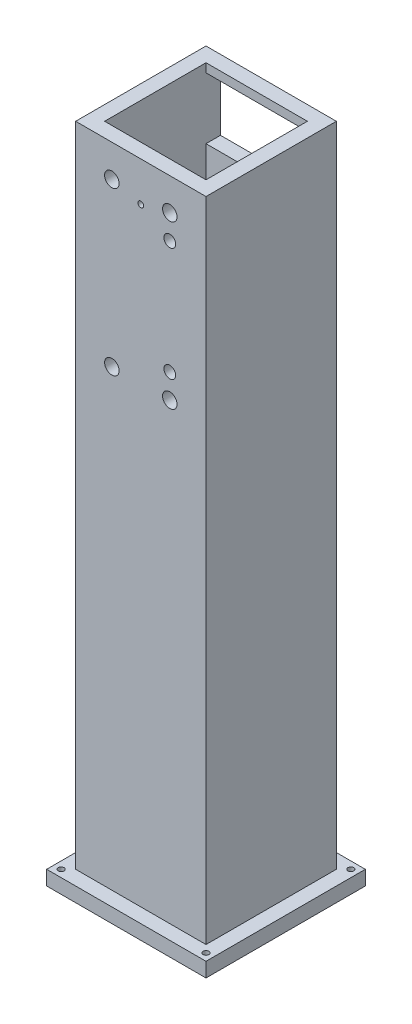
ISO-10303-21;
HEADER;
FILE_DESCRIPTION(('STEP AP214'),'2;1');
FILE_NAME('part.step','',(''),(''),'','','');
FILE_SCHEMA(('AUTOMOTIVE_DESIGN { 1 0 10303 214 1 1 1 1 }'));
ENDSEC;
DATA;
#1=APPLICATION_CONTEXT('core data for automotive mechanical design processes');
#2=APPLICATION_PROTOCOL_DEFINITION('international standard','automotive_design',2000,#1);
#3=PRODUCT_CONTEXT('',#1,'mechanical');
#4=PRODUCT('Part','Part','',(#3));
#5=PRODUCT_RELATED_PRODUCT_CATEGORY('part','',(#4));
#6=PRODUCT_DEFINITION_FORMATION('','',#4);
#7=PRODUCT_DEFINITION_CONTEXT('part definition',#1,'design');
#8=PRODUCT_DEFINITION('design','',#6,#7);
#9=PRODUCT_DEFINITION_SHAPE('','',#8);
#10=(LENGTH_UNIT() NAMED_UNIT(*) SI_UNIT(.MILLI.,.METRE.));
#11=(NAMED_UNIT(*) PLANE_ANGLE_UNIT() SI_UNIT($,.RADIAN.));
#12=(NAMED_UNIT(*) SI_UNIT($,.STERADIAN.) SOLID_ANGLE_UNIT());
#13=UNCERTAINTY_MEASURE_WITH_UNIT(LENGTH_MEASURE(1.E-05),#10,'distance_accuracy_value','');
#14=(GEOMETRIC_REPRESENTATION_CONTEXT(3) GLOBAL_UNCERTAINTY_ASSIGNED_CONTEXT((#13)) GLOBAL_UNIT_ASSIGNED_CONTEXT((#10,
#11,#12)) REPRESENTATION_CONTEXT('',''));
#15=CARTESIAN_POINT('',(0.,0.,0.));
#16=DIRECTION('',(0.,0.,1.));
#17=DIRECTION('',(1.,0.,0.));
#18=AXIS2_PLACEMENT_3D('',#15,#16,#17);
#19=CARTESIAN_POINT('',(-17.5,0.,-17.5));
#20=DIRECTION('',(0.,0.,1.));
#21=DIRECTION('',(1.,0.,0.));
#22=AXIS2_PLACEMENT_3D('',#19,#20,#21);
#23=PLANE('',#22);
#24=DIRECTION('',(1.,0.,0.));
#25=VECTOR('',#24,1.);
#26=CARTESIAN_POINT('',(-17.5,273.612120728358,-17.5));
#27=LINE('',#26,#25);
#28=CARTESIAN_POINT('',(-17.5,273.612120728358,-17.5));
#29=VERTEX_POINT('',#28);
#30=CARTESIAN_POINT('',(17.5,273.612120728358,-17.5));
#31=VERTEX_POINT('',#30);
#32=EDGE_CURVE('E264',#29,#31,#27,.T.);
#33=ORIENTED_EDGE('',*,*,#32,.F.);
#34=DIRECTION('',(0.,1.,0.));
#35=VECTOR('',#34,1.);
#36=CARTESIAN_POINT('',(-17.5,0.,-17.5));
#37=LINE('',#36,#35);
#38=CARTESIAN_POINT('',(-17.5,270.587205010945,-17.5));
#39=VERTEX_POINT('',#38);
#40=EDGE_CURVE('E309',#39,#29,#37,.T.);
#41=ORIENTED_EDGE('',*,*,#40,.F.);
#42=DIRECTION('',(1.,0.,0.));
#43=VECTOR('',#42,1.);
#44=CARTESIAN_POINT('',(-17.5,270.587205010945,-17.5));
#45=LINE('',#44,#43);
#46=CARTESIAN_POINT('',(17.5,270.587205010945,-17.5));
#47=VERTEX_POINT('',#46);
#48=EDGE_CURVE('E328',#39,#47,#45,.T.);
#49=ORIENTED_EDGE('',*,*,#48,.T.);
#50=DIRECTION('',(0.,1.,0.));
#51=VECTOR('',#50,1.);
#52=CARTESIAN_POINT('',(17.5,0.,-17.5));
#53=LINE('',#52,#51);
#54=EDGE_CURVE('E305',#47,#31,#53,.T.);
#55=ORIENTED_EDGE('',*,*,#54,.T.);
#56=EDGE_LOOP('',(#33,#41,#49,#55));
#57=FACE_BOUND('',#56,.T.);
#58=ADVANCED_FACE('F47',(#57),#23,.T.);
#59=CARTESIAN_POINT('',(22.5,300.,22.5));
#60=DIRECTION('',(-1.,0.,0.));
#61=DIRECTION('',(0.,0.,1.));
#62=AXIS2_PLACEMENT_3D('',#59,#60,#61);
#63=PLANE('',#62);
#64=DIRECTION('',(0.,-1.,0.));
#65=VECTOR('',#64,1.);
#66=CARTESIAN_POINT('',(22.5,300.,22.5));
#67=LINE('',#66,#65);
#68=CARTESIAN_POINT('',(22.5,273.612120728358,22.5));
#69=VERTEX_POINT('',#68);
#70=CARTESIAN_POINT('',(22.5,50.,22.5));
#71=VERTEX_POINT('',#70);
#72=EDGE_CURVE('E313',#69,#71,#67,.T.);
#73=ORIENTED_EDGE('',*,*,#72,.T.);
#74=DIRECTION('',(0.,0.,1.));
#75=VECTOR('',#74,1.);
#76=CARTESIAN_POINT('',(22.5,50.,22.5));
#77=LINE('',#76,#75);
#78=CARTESIAN_POINT('',(22.5,50.,-22.5));
#79=VERTEX_POINT('',#78);
#80=EDGE_CURVE('E214',#79,#71,#77,.T.);
#81=ORIENTED_EDGE('',*,*,#80,.F.);
#82=DIRECTION('',(0.,-1.,0.));
#83=VECTOR('',#82,1.);
#84=CARTESIAN_POINT('',(22.5,300.,-22.5));
#85=LINE('',#84,#83);
#86=CARTESIAN_POINT('',(22.5,273.612120728358,-22.5));
#87=VERTEX_POINT('',#86);
#88=EDGE_CURVE('E324',#87,#79,#85,.T.);
#89=ORIENTED_EDGE('',*,*,#88,.F.);
#90=DIRECTION('',(0.,0.,1.));
#91=VECTOR('',#90,1.);
#92=CARTESIAN_POINT('',(22.5,273.612120728358,-22.5));
#93=LINE('',#92,#91);
#94=EDGE_CURVE('E252',#87,#69,#93,.T.);
#95=ORIENTED_EDGE('',*,*,#94,.T.);
#96=EDGE_LOOP('',(#73,#81,#89,#95));
#97=FACE_BOUND('',#96,.T.);
#98=ADVANCED_FACE('F49',(#97),#63,.F.);
#99=CARTESIAN_POINT('',(-22.5,300.,-22.5));
#100=DIRECTION('',(0.,0.,1.));
#101=DIRECTION('',(1.,0.,0.));
#102=AXIS2_PLACEMENT_3D('',#99,#100,#101);
#103=PLANE('',#102);
#104=CARTESIAN_POINT('',(10.,214.902607410294,-22.5));
#105=DIRECTION('',(0.,0.,1.));
#106=DIRECTION('',(1.,0.,0.));
#107=AXIS2_PLACEMENT_3D('',#104,#105,#106);
#108=CIRCLE('',#107,2.03);
#109=CARTESIAN_POINT('',(12.03,214.902607410294,-22.5));
#110=VERTEX_POINT('',#109);
#111=EDGE_CURVE('E363',#110,#110,#108,.T.);
#112=ORIENTED_EDGE('',*,*,#111,.T.);
#113=EDGE_LOOP('',(#112));
#114=FACE_BOUND('',#113,.T.);
#115=CARTESIAN_POINT('',(10.,206.502607410294,-22.5));
#116=DIRECTION('',(0.,0.,1.));
#117=DIRECTION('',(1.,0.,0.));
#118=AXIS2_PLACEMENT_3D('',#115,#116,#117);
#119=CIRCLE('',#118,2.5);
#120=CARTESIAN_POINT('',(12.5,206.502607410294,-22.5));
#121=VERTEX_POINT('',#120);
#122=EDGE_CURVE('E358',#121,#121,#119,.T.);
#123=ORIENTED_EDGE('',*,*,#122,.T.);
#124=EDGE_LOOP('',(#123));
#125=FACE_BOUND('',#124,.T.);
#126=CARTESIAN_POINT('',(-10.,206.502607410294,-22.5));
#127=DIRECTION('',(0.,0.,1.));
#128=DIRECTION('',(1.,0.,0.));
#129=AXIS2_PLACEMENT_3D('',#126,#127,#128);
#130=CIRCLE('',#129,2.5);
#131=CARTESIAN_POINT('',(-7.5,206.502607410294,-22.5));
#132=VERTEX_POINT('',#131);
#133=EDGE_CURVE('E352',#132,#132,#130,.T.);
#134=ORIENTED_EDGE('',*,*,#133,.T.);
#135=EDGE_LOOP('',(#134));
#136=FACE_BOUND('',#135,.T.);
#137=DIRECTION('',(0.,1.,0.));
#138=VECTOR('',#137,1.);
#139=CARTESIAN_POINT('',(-17.5,249.412794989055,-22.5));
#140=LINE('',#139,#138);
#141=CARTESIAN_POINT('',(-17.5,249.412794989055,-22.5));
#142=VERTEX_POINT('',#141);
#143=CARTESIAN_POINT('',(-17.5,270.587205010945,-22.5));
#144=VERTEX_POINT('',#143);
#145=EDGE_CURVE('E275',#142,#144,#140,.T.);
#146=ORIENTED_EDGE('',*,*,#145,.F.);
#147=DIRECTION('',(-1.,0.,0.));
#148=VECTOR('',#147,1.);
#149=CARTESIAN_POINT('',(17.5,249.412794989055,-22.5));
#150=LINE('',#149,#148);
#151=CARTESIAN_POINT('',(17.5,249.412794989055,-22.5));
#152=VERTEX_POINT('',#151);
#153=EDGE_CURVE('E272',#152,#142,#150,.T.);
#154=ORIENTED_EDGE('',*,*,#153,.F.);
#155=DIRECTION('',(0.,1.,0.));
#156=VECTOR('',#155,1.);
#157=CARTESIAN_POINT('',(17.5,249.412794989055,-22.5));
#158=LINE('',#157,#156);
#159=CARTESIAN_POINT('',(17.5,270.587205010945,-22.5));
#160=VERTEX_POINT('',#159);
#161=EDGE_CURVE('E283',#152,#160,#158,.T.);
#162=ORIENTED_EDGE('',*,*,#161,.T.);
#163=DIRECTION('',(-1.,0.,0.));
#164=VECTOR('',#163,1.);
#165=CARTESIAN_POINT('',(17.5,270.587205010945,-22.5));
#166=LINE('',#165,#164);
#167=EDGE_CURVE('E279',#160,#144,#166,.T.);
#168=ORIENTED_EDGE('',*,*,#167,.T.);
#169=EDGE_LOOP('',(#146,#154,#162,#168));
#170=FACE_BOUND('',#169,.T.);
#171=ORIENTED_EDGE('',*,*,#88,.T.);
#172=DIRECTION('',(1.,0.,0.));
#173=VECTOR('',#172,1.);
#174=CARTESIAN_POINT('',(-22.5,50.,-22.5));
#175=LINE('',#174,#173);
#176=CARTESIAN_POINT('',(-22.5,50.,-22.5));
#177=VERTEX_POINT('',#176);
#178=EDGE_CURVE('E227',#177,#79,#175,.T.);
#179=ORIENTED_EDGE('',*,*,#178,.F.);
#180=DIRECTION('',(0.,-1.,0.));
#181=VECTOR('',#180,1.);
#182=CARTESIAN_POINT('',(-22.5,300.,-22.5));
#183=LINE('',#182,#181);
#184=CARTESIAN_POINT('',(-22.5,273.612120728358,-22.5));
#185=VERTEX_POINT('',#184);
#186=EDGE_CURVE('E320',#185,#177,#183,.T.);
#187=ORIENTED_EDGE('',*,*,#186,.F.);
#188=DIRECTION('',(1.,0.,0.));
#189=VECTOR('',#188,1.);
#190=CARTESIAN_POINT('',(-22.5,273.612120728358,-22.5));
#191=LINE('',#190,#189);
#192=EDGE_CURVE('E246',#185,#87,#191,.T.);
#193=ORIENTED_EDGE('',*,*,#192,.T.);
#194=EDGE_LOOP('',(#171,#179,#187,#193));
#195=FACE_BOUND('',#194,.T.);
#196=ADVANCED_FACE('F442',(#114,#125,#136,#170,#195),#103,.F.);
#197=CARTESIAN_POINT('',(-22.5,300.,22.5));
#198=DIRECTION('',(1.,0.,0.));
#199=DIRECTION('',(0.,0.,-1.));
#200=AXIS2_PLACEMENT_3D('',#197,#198,#199);
#201=PLANE('',#200);
#202=ORIENTED_EDGE('',*,*,#186,.T.);
#203=DIRECTION('',(0.,0.,1.));
#204=VECTOR('',#203,1.);
#205=CARTESIAN_POINT('',(-22.5,50.,22.5));
#206=LINE('',#205,#204);
#207=CARTESIAN_POINT('',(-22.5,50.,22.5));
#208=VERTEX_POINT('',#207);
#209=EDGE_CURVE('E224',#177,#208,#206,.T.);
#210=ORIENTED_EDGE('',*,*,#209,.T.);
#211=DIRECTION('',(0.,-1.,0.));
#212=VECTOR('',#211,1.);
#213=CARTESIAN_POINT('',(-22.5,300.,22.5));
#214=LINE('',#213,#212);
#215=CARTESIAN_POINT('',(-22.5,273.612120728358,22.5));
#216=VERTEX_POINT('',#215);
#217=EDGE_CURVE('E316',#216,#208,#214,.T.);
#218=ORIENTED_EDGE('',*,*,#217,.F.);
#219=DIRECTION('',(0.,0.,1.));
#220=VECTOR('',#219,1.);
#221=CARTESIAN_POINT('',(-22.5,273.612120728358,-22.5));
#222=LINE('',#221,#220);
#223=EDGE_CURVE('E65',#185,#216,#222,.T.);
#224=ORIENTED_EDGE('',*,*,#223,.F.);
#225=EDGE_LOOP('',(#202,#210,#218,#224));
#226=FACE_BOUND('',#225,.T.);
#227=ADVANCED_FACE('F439',(#226),#201,.F.);
#228=CARTESIAN_POINT('',(-22.5,300.,22.5));
#229=DIRECTION('',(0.,0.,-1.));
#230=DIRECTION('',(-1.,0.,0.));
#231=AXIS2_PLACEMENT_3D('',#228,#229,#230);
#232=PLANE('',#231);
#233=CARTESIAN_POINT('',(10.,214.902607410294,22.5));
#234=DIRECTION('',(0.,0.,-1.));
#235=DIRECTION('',(-1.,0.,0.));
#236=AXIS2_PLACEMENT_3D('',#233,#234,#235);
#237=CIRCLE('',#236,2.03);
#238=CARTESIAN_POINT('',(7.97000000000001,214.902607410294,22.5));
#239=VERTEX_POINT('',#238);
#240=EDGE_CURVE('E561',#239,#239,#237,.T.);
#241=ORIENTED_EDGE('',*,*,#240,.T.);
#242=EDGE_LOOP('',(#241));
#243=FACE_BOUND('',#242,.T.);
#244=CARTESIAN_POINT('',(10.,206.502607410294,22.5));
#245=DIRECTION('',(0.,0.,-1.));
#246=DIRECTION('',(-1.,0.,0.));
#247=AXIS2_PLACEMENT_3D('',#244,#245,#246);
#248=CIRCLE('',#247,2.5);
#249=CARTESIAN_POINT('',(7.5,206.502607410294,22.5));
#250=VERTEX_POINT('',#249);
#251=EDGE_CURVE('E553',#250,#250,#248,.T.);
#252=ORIENTED_EDGE('',*,*,#251,.T.);
#253=EDGE_LOOP('',(#252));
#254=FACE_BOUND('',#253,.T.);
#255=CARTESIAN_POINT('',(10.,262.502607410294,22.5));
#256=DIRECTION('',(0.,0.,-1.));
#257=DIRECTION('',(-1.,0.,0.));
#258=AXIS2_PLACEMENT_3D('',#255,#256,#257);
#259=CIRCLE('',#258,2.5);
#260=CARTESIAN_POINT('',(7.5,262.502607410294,22.5));
#261=VERTEX_POINT('',#260);
#262=EDGE_CURVE('E381',#261,#261,#259,.T.);
#263=ORIENTED_EDGE('',*,*,#262,.T.);
#264=EDGE_LOOP('',(#263));
#265=FACE_BOUND('',#264,.T.);
#266=CARTESIAN_POINT('',(-10.,206.502607410294,22.5));
#267=DIRECTION('',(0.,0.,-1.));
#268=DIRECTION('',(-1.,0.,0.));
#269=AXIS2_PLACEMENT_3D('',#266,#267,#268);
#270=CIRCLE('',#269,2.5);
#271=CARTESIAN_POINT('',(-12.5,206.502607410294,22.5));
#272=VERTEX_POINT('',#271);
#273=EDGE_CURVE('E543',#272,#272,#270,.T.);
#274=ORIENTED_EDGE('',*,*,#273,.T.);
#275=EDGE_LOOP('',(#274));
#276=FACE_BOUND('',#275,.T.);
#277=CARTESIAN_POINT('',(10.,254.102607410294,22.5));
#278=DIRECTION('',(0.,0.,-1.));
#279=DIRECTION('',(-1.,0.,0.));
#280=AXIS2_PLACEMENT_3D('',#277,#278,#279);
#281=CIRCLE('',#280,2.03);
#282=CARTESIAN_POINT('',(7.97000000000001,254.102607410294,22.5));
#283=VERTEX_POINT('',#282);
#284=EDGE_CURVE('E367',#283,#283,#281,.T.);
#285=ORIENTED_EDGE('',*,*,#284,.T.);
#286=EDGE_LOOP('',(#285));
#287=FACE_BOUND('',#286,.T.);
#288=CARTESIAN_POINT('',(-10.,262.502607410294,22.5));
#289=DIRECTION('',(0.,0.,-1.));
#290=DIRECTION('',(-1.,0.,0.));
#291=AXIS2_PLACEMENT_3D('',#288,#289,#290);
#292=CIRCLE('',#291,2.5);
#293=CARTESIAN_POINT('',(-12.5,262.502607410294,22.5));
#294=VERTEX_POINT('',#293);
#295=EDGE_CURVE('E362',#294,#294,#292,.T.);
#296=ORIENTED_EDGE('',*,*,#295,.T.);
#297=EDGE_LOOP('',(#296));
#298=FACE_BOUND('',#297,.T.);
#299=CARTESIAN_POINT('',(0.,260.,22.5));
#300=DIRECTION('',(0.,0.,1.));
#301=DIRECTION('',(1.,0.,0.));
#302=AXIS2_PLACEMENT_3D('',#299,#300,#301);
#303=CIRCLE('',#302,1.);
#304=CARTESIAN_POINT('',(1.,260.,22.5));
#305=VERTEX_POINT('',#304);
#306=EDGE_CURVE('E267',#305,#305,#303,.T.);
#307=ORIENTED_EDGE('',*,*,#306,.F.);
#308=EDGE_LOOP('',(#307));
#309=FACE_BOUND('',#308,.T.);
#310=ORIENTED_EDGE('',*,*,#217,.T.);
#311=DIRECTION('',(1.,0.,0.));
#312=VECTOR('',#311,1.);
#313=CARTESIAN_POINT('',(-22.5,50.,22.5));
#314=LINE('',#313,#312);
#315=EDGE_CURVE('E228',#208,#71,#314,.T.);
#316=ORIENTED_EDGE('',*,*,#315,.T.);
#317=ORIENTED_EDGE('',*,*,#72,.F.);
#318=DIRECTION('',(1.,0.,0.));
#319=VECTOR('',#318,1.);
#320=CARTESIAN_POINT('',(-22.5,273.612120728358,22.5));
#321=LINE('',#320,#319);
#322=EDGE_CURVE('E245',#216,#69,#321,.T.);
#323=ORIENTED_EDGE('',*,*,#322,.F.);
#324=EDGE_LOOP('',(#310,#316,#317,#323));
#325=FACE_BOUND('',#324,.T.);
#326=ADVANCED_FACE('F436',(#243,#254,#265,#276,#287,#298,#309,#325),#232,.F.);
#327=CARTESIAN_POINT('',(-17.5,0.,17.5));
#328=DIRECTION('',(1.,0.,0.));
#329=DIRECTION('',(0.,0.,-1.));
#330=AXIS2_PLACEMENT_3D('',#327,#328,#329);
#331=PLANE('',#330);
#332=DIRECTION('',(0.,0.,1.));
#333=VECTOR('',#332,1.);
#334=CARTESIAN_POINT('',(-17.5,50.,17.5));
#335=LINE('',#334,#333);
#336=CARTESIAN_POINT('',(-17.5,50.,-17.5));
#337=VERTEX_POINT('',#336);
#338=CARTESIAN_POINT('',(-17.5,50.,17.5));
#339=VERTEX_POINT('',#338);
#340=EDGE_CURVE('E238',#337,#339,#335,.T.);
#341=ORIENTED_EDGE('',*,*,#340,.F.);
#342=CARTESIAN_POINT('',(-17.5,249.412794989055,-17.5));
#343=VERTEX_POINT('',#342);
#344=EDGE_CURVE('E310',#337,#343,#37,.T.);
#345=ORIENTED_EDGE('',*,*,#344,.T.);
#346=DIRECTION('',(0.,0.,-1.));
#347=VECTOR('',#346,1.);
#348=CARTESIAN_POINT('',(-17.5,249.412794989055,-12.5));
#349=LINE('',#348,#347);
#350=EDGE_CURVE('E287',#343,#142,#349,.T.);
#351=ORIENTED_EDGE('',*,*,#350,.T.);
#352=ORIENTED_EDGE('',*,*,#145,.T.);
#353=DIRECTION('',(0.,0.,-1.));
#354=VECTOR('',#353,1.);
#355=CARTESIAN_POINT('',(-17.5,270.587205010945,-12.5));
#356=LINE('',#355,#354);
#357=EDGE_CURVE('E295',#39,#144,#356,.T.);
#358=ORIENTED_EDGE('',*,*,#357,.F.);
#359=ORIENTED_EDGE('',*,*,#40,.T.);
#360=DIRECTION('',(0.,0.,-1.));
#361=VECTOR('',#360,1.);
#362=CARTESIAN_POINT('',(-17.5,273.612120728358,17.5));
#363=LINE('',#362,#361);
#364=CARTESIAN_POINT('',(-17.5,273.612120728358,17.5));
#365=VERTEX_POINT('',#364);
#366=EDGE_CURVE('E261',#365,#29,#363,.T.);
#367=ORIENTED_EDGE('',*,*,#366,.F.);
#368=DIRECTION('',(0.,1.,0.));
#369=VECTOR('',#368,1.);
#370=CARTESIAN_POINT('',(-17.5,0.,17.5));
#371=LINE('',#370,#369);
#372=EDGE_CURVE('E291',#339,#365,#371,.T.);
#373=ORIENTED_EDGE('',*,*,#372,.F.);
#374=EDGE_LOOP('',(#341,#345,#351,#352,#358,#359,#367,#373));
#375=FACE_BOUND('',#374,.T.);
#376=ADVANCED_FACE('F499',(#375),#331,.T.);
#377=CARTESIAN_POINT('',(17.5,0.,17.5));
#378=DIRECTION('',(1.,0.,0.));
#379=DIRECTION('',(0.,0.,-1.));
#380=AXIS2_PLACEMENT_3D('',#377,#378,#379);
#381=PLANE('',#380);
#382=CARTESIAN_POINT('',(17.5,50.,-17.5));
#383=VERTEX_POINT('',#382);
#384=CARTESIAN_POINT('',(17.5,249.412794989055,-17.5));
#385=VERTEX_POINT('',#384);
#386=EDGE_CURVE('E306',#383,#385,#53,.T.);
#387=ORIENTED_EDGE('',*,*,#386,.F.);
#388=DIRECTION('',(0.,0.,1.));
#389=VECTOR('',#388,1.);
#390=CARTESIAN_POINT('',(17.5,50.,17.5));
#391=LINE('',#390,#389);
#392=CARTESIAN_POINT('',(17.5,50.,17.5));
#393=VERTEX_POINT('',#392);
#394=EDGE_CURVE('E232',#383,#393,#391,.T.);
#395=ORIENTED_EDGE('',*,*,#394,.T.);
#396=DIRECTION('',(0.,1.,0.));
#397=VECTOR('',#396,1.);
#398=CARTESIAN_POINT('',(17.5,0.,17.5));
#399=LINE('',#398,#397);
#400=CARTESIAN_POINT('',(17.5,273.612120728358,17.5));
#401=VERTEX_POINT('',#400);
#402=EDGE_CURVE('E73',#393,#401,#399,.T.);
#403=ORIENTED_EDGE('',*,*,#402,.T.);
#404=DIRECTION('',(0.,0.,-1.));
#405=VECTOR('',#404,1.);
#406=CARTESIAN_POINT('',(17.5,273.612120728358,17.5));
#407=LINE('',#406,#405);
#408=EDGE_CURVE('E256',#401,#31,#407,.T.);
#409=ORIENTED_EDGE('',*,*,#408,.T.);
#410=ORIENTED_EDGE('',*,*,#54,.F.);
#411=DIRECTION('',(0.,0.,-1.));
#412=VECTOR('',#411,1.);
#413=CARTESIAN_POINT('',(17.5,270.587205010945,-12.5));
#414=LINE('',#413,#412);
#415=EDGE_CURVE('E292',#47,#160,#414,.T.);
#416=ORIENTED_EDGE('',*,*,#415,.T.);
#417=ORIENTED_EDGE('',*,*,#161,.F.);
#418=DIRECTION('',(0.,0.,-1.));
#419=VECTOR('',#418,1.);
#420=CARTESIAN_POINT('',(17.5,249.412794989055,-12.5));
#421=LINE('',#420,#419);
#422=EDGE_CURVE('E288',#385,#152,#421,.T.);
#423=ORIENTED_EDGE('',*,*,#422,.F.);
#424=EDGE_LOOP('',(#387,#395,#403,#409,#410,#416,#417,#423));
#425=FACE_BOUND('',#424,.T.);
#426=ADVANCED_FACE('F479',(#425),#381,.F.);
#427=CARTESIAN_POINT('',(-17.5,0.,17.5));
#428=DIRECTION('',(0.,0.,1.));
#429=DIRECTION('',(1.,0.,0.));
#430=AXIS2_PLACEMENT_3D('',#427,#428,#429);
#431=PLANE('',#430);
#432=CARTESIAN_POINT('',(10.,214.902607410294,17.5));
#433=DIRECTION('',(0.,0.,1.));
#434=DIRECTION('',(1.,0.,0.));
#435=AXIS2_PLACEMENT_3D('',#432,#433,#434);
#436=CIRCLE('',#435,2.03);
#437=CARTESIAN_POINT('',(12.03,214.902607410294,17.5));
#438=VERTEX_POINT('',#437);
#439=EDGE_CURVE('E357',#438,#438,#436,.T.);
#440=ORIENTED_EDGE('',*,*,#439,.T.);
#441=EDGE_LOOP('',(#440));
#442=FACE_BOUND('',#441,.T.);
#443=CARTESIAN_POINT('',(10.,206.502607410294,17.5));
#444=DIRECTION('',(0.,0.,1.));
#445=DIRECTION('',(1.,0.,0.));
#446=AXIS2_PLACEMENT_3D('',#443,#444,#445);
#447=CIRCLE('',#446,2.5);
#448=CARTESIAN_POINT('',(12.5,206.502607410294,17.5));
#449=VERTEX_POINT('',#448);
#450=EDGE_CURVE('E351',#449,#449,#447,.T.);
#451=ORIENTED_EDGE('',*,*,#450,.T.);
#452=EDGE_LOOP('',(#451));
#453=FACE_BOUND('',#452,.T.);
#454=CARTESIAN_POINT('',(10.,262.502607410294,17.5));
#455=DIRECTION('',(0.,0.,1.));
#456=DIRECTION('',(1.,0.,0.));
#457=AXIS2_PLACEMENT_3D('',#454,#455,#456);
#458=CIRCLE('',#457,2.5);
#459=CARTESIAN_POINT('',(12.5,262.502607410294,17.5));
#460=VERTEX_POINT('',#459);
#461=EDGE_CURVE('E51',#460,#460,#458,.T.);
#462=ORIENTED_EDGE('',*,*,#461,.T.);
#463=EDGE_LOOP('',(#462));
#464=FACE_BOUND('',#463,.T.);
#465=CARTESIAN_POINT('',(-10.,206.502607410294,17.5));
#466=DIRECTION('',(0.,0.,1.));
#467=DIRECTION('',(1.,0.,0.));
#468=AXIS2_PLACEMENT_3D('',#465,#466,#467);
#469=CIRCLE('',#468,2.5);
#470=CARTESIAN_POINT('',(-7.5,206.502607410294,17.5));
#471=VERTEX_POINT('',#470);
#472=EDGE_CURVE('E346',#471,#471,#469,.T.);
#473=ORIENTED_EDGE('',*,*,#472,.T.);
#474=EDGE_LOOP('',(#473));
#475=FACE_BOUND('',#474,.T.);
#476=CARTESIAN_POINT('',(10.,254.102607410294,17.5));
#477=DIRECTION('',(0.,0.,1.));
#478=DIRECTION('',(1.,0.,0.));
#479=AXIS2_PLACEMENT_3D('',#476,#477,#478);
#480=CIRCLE('',#479,2.03);
#481=CARTESIAN_POINT('',(12.03,254.102607410294,17.5));
#482=VERTEX_POINT('',#481);
#483=EDGE_CURVE('E364',#482,#482,#480,.T.);
#484=ORIENTED_EDGE('',*,*,#483,.T.);
#485=EDGE_LOOP('',(#484));
#486=FACE_BOUND('',#485,.T.);
#487=CARTESIAN_POINT('',(-10.,262.502607410294,17.5));
#488=DIRECTION('',(0.,0.,1.));
#489=DIRECTION('',(1.,0.,0.));
#490=AXIS2_PLACEMENT_3D('',#487,#488,#489);
#491=CIRCLE('',#490,2.5);
#492=CARTESIAN_POINT('',(-7.5,262.502607410294,17.5));
#493=VERTEX_POINT('',#492);
#494=EDGE_CURVE('E359',#493,#493,#491,.T.);
#495=ORIENTED_EDGE('',*,*,#494,.T.);
#496=EDGE_LOOP('',(#495));
#497=FACE_BOUND('',#496,.T.);
#498=CARTESIAN_POINT('',(0.,260.,17.5));
#499=DIRECTION('',(0.,0.,1.));
#500=DIRECTION('',(1.,0.,0.));
#501=AXIS2_PLACEMENT_3D('',#498,#499,#500);
#502=CIRCLE('',#501,1.);
#503=CARTESIAN_POINT('',(1.,260.,17.5));
#504=VERTEX_POINT('',#503);
#505=EDGE_CURVE('E271',#504,#504,#502,.T.);
#506=ORIENTED_EDGE('',*,*,#505,.T.);
#507=EDGE_LOOP('',(#506));
#508=FACE_BOUND('',#507,.T.);
#509=ORIENTED_EDGE('',*,*,#402,.F.);
#510=DIRECTION('',(-1.,0.,0.));
#511=VECTOR('',#510,1.);
#512=CARTESIAN_POINT('',(-17.5,50.,17.5));
#513=LINE('',#512,#511);
#514=EDGE_CURVE('E241',#393,#339,#513,.T.);
#515=ORIENTED_EDGE('',*,*,#514,.T.);
#516=ORIENTED_EDGE('',*,*,#372,.T.);
#517=DIRECTION('',(1.,0.,0.));
#518=VECTOR('',#517,1.);
#519=CARTESIAN_POINT('',(-17.5,273.612120728358,17.5));
#520=LINE('',#519,#518);
#521=EDGE_CURVE('E57',#365,#401,#520,.T.);
#522=ORIENTED_EDGE('',*,*,#521,.T.);
#523=EDGE_LOOP('',(#509,#515,#516,#522));
#524=FACE_BOUND('',#523,.T.);
#525=ADVANCED_FACE('F471',(#442,#453,#464,#475,#486,#497,#508,#524),#431,.F.);
#526=CARTESIAN_POINT('',(10.,214.902607410294,-17.5));
#527=DIRECTION('',(0.,0.,1.));
#528=DIRECTION('',(1.,0.,0.));
#529=AXIS2_PLACEMENT_3D('',#526,#527,#528);
#530=CIRCLE('',#529,2.03);
#531=CARTESIAN_POINT('',(12.03,214.902607410294,-17.5));
#532=VERTEX_POINT('',#531);
#533=EDGE_CURVE('E353',#532,#532,#530,.T.);
#534=ORIENTED_EDGE('',*,*,#533,.F.);
#535=EDGE_LOOP('',(#534));
#536=FACE_BOUND('',#535,.T.);
#537=CARTESIAN_POINT('',(10.,206.502607410294,-17.5));
#538=DIRECTION('',(0.,0.,1.));
#539=DIRECTION('',(1.,0.,0.));
#540=AXIS2_PLACEMENT_3D('',#537,#538,#539);
#541=CIRCLE('',#540,2.5);
#542=CARTESIAN_POINT('',(12.5,206.502607410294,-17.5));
#543=VERTEX_POINT('',#542);
#544=EDGE_CURVE('E347',#543,#543,#541,.T.);
#545=ORIENTED_EDGE('',*,*,#544,.F.);
#546=EDGE_LOOP('',(#545));
#547=FACE_BOUND('',#546,.T.);
#548=CARTESIAN_POINT('',(-10.,206.502607410294,-17.5));
#549=DIRECTION('',(0.,0.,1.));
#550=DIRECTION('',(1.,0.,0.));
#551=AXIS2_PLACEMENT_3D('',#548,#549,#550);
#552=CIRCLE('',#551,2.5);
#553=CARTESIAN_POINT('',(-7.5,206.502607410294,-17.5));
#554=VERTEX_POINT('',#553);
#555=EDGE_CURVE('E342',#554,#554,#552,.T.);
#556=ORIENTED_EDGE('',*,*,#555,.F.);
#557=EDGE_LOOP('',(#556));
#558=FACE_BOUND('',#557,.T.);
#559=DIRECTION('',(-1.,0.,0.));
#560=VECTOR('',#559,1.);
#561=CARTESIAN_POINT('',(-17.5,50.,-17.5));
#562=LINE('',#561,#560);
#563=EDGE_CURVE('E11',#383,#337,#562,.T.);
#564=ORIENTED_EDGE('',*,*,#563,.F.);
#565=ORIENTED_EDGE('',*,*,#386,.T.);
#566=DIRECTION('',(1.,0.,0.));
#567=VECTOR('',#566,1.);
#568=CARTESIAN_POINT('',(-17.5,249.412794989055,-17.5));
#569=LINE('',#568,#567);
#570=EDGE_CURVE('E332',#343,#385,#569,.T.);
#571=ORIENTED_EDGE('',*,*,#570,.F.);
#572=ORIENTED_EDGE('',*,*,#344,.F.);
#573=EDGE_LOOP('',(#564,#565,#571,#572));
#574=FACE_BOUND('',#573,.T.);
#575=ADVANCED_FACE('F462',(#536,#547,#558,#574),#23,.T.);
#576=CARTESIAN_POINT('',(17.5,249.412794989055,-12.5));
#577=DIRECTION('',(0.,-1.,0.));
#578=DIRECTION('',(0.,0.,-1.));
#579=AXIS2_PLACEMENT_3D('',#576,#577,#578);
#580=PLANE('',#579);
#581=ORIENTED_EDGE('',*,*,#570,.T.);
#582=ORIENTED_EDGE('',*,*,#422,.T.);
#583=ORIENTED_EDGE('',*,*,#153,.T.);
#584=ORIENTED_EDGE('',*,*,#350,.F.);
#585=EDGE_LOOP('',(#581,#582,#583,#584));
#586=FACE_BOUND('',#585,.T.);
#587=ADVANCED_FACE('F470',(#586),#580,.F.);
#588=CARTESIAN_POINT('',(17.5,270.587205010945,-12.5));
#589=DIRECTION('',(0.,-1.,0.));
#590=DIRECTION('',(0.,0.,-1.));
#591=AXIS2_PLACEMENT_3D('',#588,#589,#590);
#592=PLANE('',#591);
#593=ORIENTED_EDGE('',*,*,#357,.T.);
#594=ORIENTED_EDGE('',*,*,#167,.F.);
#595=ORIENTED_EDGE('',*,*,#415,.F.);
#596=ORIENTED_EDGE('',*,*,#48,.F.);
#597=EDGE_LOOP('',(#593,#594,#595,#596));
#598=FACE_BOUND('',#597,.T.);
#599=ADVANCED_FACE('F455',(#598),#592,.T.);
#600=CARTESIAN_POINT('',(0.,260.,12.5));
#601=DIRECTION('',(0.,0.,1.));
#602=DIRECTION('',(1.,0.,0.));
#603=AXIS2_PLACEMENT_3D('',#600,#601,#602);
#604=CYLINDRICAL_SURFACE('',#603,1.);
#605=ORIENTED_EDGE('',*,*,#306,.T.);
#606=EDGE_LOOP('',(#605));
#607=FACE_BOUND('',#606,.T.);
#608=ORIENTED_EDGE('',*,*,#505,.F.);
#609=EDGE_LOOP('',(#608));
#610=FACE_BOUND('',#609,.T.);
#611=ADVANCED_FACE('F447',(#607,#610),#604,.F.);
#612=CARTESIAN_POINT('',(-22.5,273.612120728358,-22.5));
#613=DIRECTION('',(0.,-1.,0.));
#614=DIRECTION('',(0.,0.,-1.));
#615=AXIS2_PLACEMENT_3D('',#612,#613,#614);
#616=PLANE('',#615);
#617=ORIENTED_EDGE('',*,*,#32,.T.);
#618=ORIENTED_EDGE('',*,*,#408,.F.);
#619=ORIENTED_EDGE('',*,*,#521,.F.);
#620=ORIENTED_EDGE('',*,*,#366,.T.);
#621=EDGE_LOOP('',(#617,#618,#619,#620));
#622=FACE_BOUND('',#621,.T.);
#623=ORIENTED_EDGE('',*,*,#322,.T.);
#624=ORIENTED_EDGE('',*,*,#94,.F.);
#625=ORIENTED_EDGE('',*,*,#192,.F.);
#626=ORIENTED_EDGE('',*,*,#223,.T.);
#627=EDGE_LOOP('',(#623,#624,#625,#626));
#628=FACE_BOUND('',#627,.T.);
#629=ADVANCED_FACE('F445',(#622,#628),#616,.F.);
#630=CARTESIAN_POINT('',(0.,50.,0.));
#631=DIRECTION('',(0.,1.,0.));
#632=DIRECTION('',(0.,0.,1.));
#633=AXIS2_PLACEMENT_3D('',#630,#631,#632);
#634=PLANE('',#633);
#635=ORIENTED_EDGE('',*,*,#394,.F.);
#636=ORIENTED_EDGE('',*,*,#563,.T.);
#637=ORIENTED_EDGE('',*,*,#340,.T.);
#638=ORIENTED_EDGE('',*,*,#514,.F.);
#639=EDGE_LOOP('',(#635,#636,#637,#638));
#640=FACE_BOUND('',#639,.T.);
#641=ADVANCED_FACE('F423',(#640),#634,.T.);
#642=CARTESIAN_POINT('',(25.,50.,-25.));
#643=DIRECTION('',(0.,1.,0.));
#644=DIRECTION('',(0.,0.,1.));
#645=AXIS2_PLACEMENT_3D('',#642,#643,#644);
#646=CIRCLE('',#645,1.);
#647=CARTESIAN_POINT('',(25.,50.,-24.));
#648=VERTEX_POINT('',#647);
#649=EDGE_CURVE('E197',#648,#648,#646,.T.);
#650=ORIENTED_EDGE('',*,*,#649,.F.);
#651=EDGE_LOOP('',(#650));
#652=FACE_BOUND('',#651,.T.);
#653=CARTESIAN_POINT('',(-25.,50.,-25.));
#654=DIRECTION('',(0.,1.,0.));
#655=DIRECTION('',(0.,0.,1.));
#656=AXIS2_PLACEMENT_3D('',#653,#654,#655);
#657=CIRCLE('',#656,1.);
#658=CARTESIAN_POINT('',(-25.,50.,-24.));
#659=VERTEX_POINT('',#658);
#660=EDGE_CURVE('E408',#659,#659,#657,.T.);
#661=ORIENTED_EDGE('',*,*,#660,.F.);
#662=EDGE_LOOP('',(#661));
#663=FACE_BOUND('',#662,.T.);
#664=CARTESIAN_POINT('',(-25.,50.,25.));
#665=DIRECTION('',(0.,1.,0.));
#666=DIRECTION('',(0.,0.,1.));
#667=AXIS2_PLACEMENT_3D('',#664,#665,#666);
#668=CIRCLE('',#667,1.);
#669=CARTESIAN_POINT('',(-25.,50.,26.));
#670=VERTEX_POINT('',#669);
#671=EDGE_CURVE('E405',#670,#670,#668,.T.);
#672=ORIENTED_EDGE('',*,*,#671,.F.);
#673=EDGE_LOOP('',(#672));
#674=FACE_BOUND('',#673,.T.);
#675=CARTESIAN_POINT('',(25.,50.,25.));
#676=DIRECTION('',(0.,1.,0.));
#677=DIRECTION('',(0.,0.,1.));
#678=AXIS2_PLACEMENT_3D('',#675,#676,#677);
#679=CIRCLE('',#678,1.);
#680=CARTESIAN_POINT('',(25.,50.,26.));
#681=VERTEX_POINT('',#680);
#682=EDGE_CURVE('E401',#681,#681,#679,.T.);
#683=ORIENTED_EDGE('',*,*,#682,.F.);
#684=EDGE_LOOP('',(#683));
#685=FACE_BOUND('',#684,.T.);
#686=DIRECTION('',(0.,0.,1.));
#687=VECTOR('',#686,1.);
#688=CARTESIAN_POINT('',(-27.5,50.,-27.5));
#689=LINE('',#688,#687);
#690=CARTESIAN_POINT('',(-27.5,50.,-27.5));
#691=VERTEX_POINT('',#690);
#692=CARTESIAN_POINT('',(-27.5,50.,27.5));
#693=VERTEX_POINT('',#692);
#694=EDGE_CURVE('E204',#691,#693,#689,.T.);
#695=ORIENTED_EDGE('',*,*,#694,.T.);
#696=DIRECTION('',(1.,0.,0.));
#697=VECTOR('',#696,1.);
#698=CARTESIAN_POINT('',(-27.5,50.,27.5));
#699=LINE('',#698,#697);
#700=CARTESIAN_POINT('',(27.5,50.,27.5));
#701=VERTEX_POINT('',#700);
#702=EDGE_CURVE('E169',#693,#701,#699,.T.);
#703=ORIENTED_EDGE('',*,*,#702,.T.);
#704=DIRECTION('',(0.,0.,1.));
#705=VECTOR('',#704,1.);
#706=CARTESIAN_POINT('',(27.5,50.,-27.5));
#707=LINE('',#706,#705);
#708=CARTESIAN_POINT('',(27.5,50.,-27.5));
#709=VERTEX_POINT('',#708);
#710=EDGE_CURVE('E194',#709,#701,#707,.T.);
#711=ORIENTED_EDGE('',*,*,#710,.F.);
#712=DIRECTION('',(1.,0.,0.));
#713=VECTOR('',#712,1.);
#714=CARTESIAN_POINT('',(-27.5,50.,-27.5));
#715=LINE('',#714,#713);
#716=EDGE_CURVE('E191',#691,#709,#715,.T.);
#717=ORIENTED_EDGE('',*,*,#716,.F.);
#718=EDGE_LOOP('',(#695,#703,#711,#717));
#719=FACE_BOUND('',#718,.T.);
#720=ORIENTED_EDGE('',*,*,#315,.F.);
#721=ORIENTED_EDGE('',*,*,#209,.F.);
#722=ORIENTED_EDGE('',*,*,#178,.T.);
#723=ORIENTED_EDGE('',*,*,#80,.T.);
#724=EDGE_LOOP('',(#720,#721,#722,#723));
#725=FACE_BOUND('',#724,.T.);
#726=ADVANCED_FACE('F420',(#652,#663,#674,#685,#719,#725),#634,.T.);
#727=CARTESIAN_POINT('',(-27.5,45.,-27.5));
#728=DIRECTION('',(-1.,0.,0.));
#729=DIRECTION('',(0.,0.,1.));
#730=AXIS2_PLACEMENT_3D('',#727,#728,#729);
#731=PLANE('',#730);
#732=ORIENTED_EDGE('',*,*,#694,.F.);
#733=DIRECTION('',(0.,1.,0.));
#734=VECTOR('',#733,1.);
#735=CARTESIAN_POINT('',(-27.5,45.,-27.5));
#736=LINE('',#735,#734);
#737=CARTESIAN_POINT('',(-27.5,45.,-27.5));
#738=VERTEX_POINT('',#737);
#739=EDGE_CURVE('E188',#738,#691,#736,.T.);
#740=ORIENTED_EDGE('',*,*,#739,.F.);
#741=DIRECTION('',(0.,0.,1.));
#742=VECTOR('',#741,1.);
#743=CARTESIAN_POINT('',(-27.5,45.,-27.5));
#744=LINE('',#743,#742);
#745=CARTESIAN_POINT('',(-27.5,45.,27.5));
#746=VERTEX_POINT('',#745);
#747=EDGE_CURVE('E181',#738,#746,#744,.T.);
#748=ORIENTED_EDGE('',*,*,#747,.T.);
#749=DIRECTION('',(0.,1.,0.));
#750=VECTOR('',#749,1.);
#751=CARTESIAN_POINT('',(-27.5,45.,27.5));
#752=LINE('',#751,#750);
#753=EDGE_CURVE('E164',#746,#693,#752,.T.);
#754=ORIENTED_EDGE('',*,*,#753,.T.);
#755=EDGE_LOOP('',(#732,#740,#748,#754));
#756=FACE_BOUND('',#755,.T.);
#757=ADVANCED_FACE('F187',(#756),#731,.T.);
#758=CARTESIAN_POINT('',(-27.5,45.,-27.5));
#759=DIRECTION('',(0.,0.,1.));
#760=DIRECTION('',(1.,0.,0.));
#761=AXIS2_PLACEMENT_3D('',#758,#759,#760);
#762=PLANE('',#761);
#763=ORIENTED_EDGE('',*,*,#716,.T.);
#764=DIRECTION('',(0.,1.,0.));
#765=VECTOR('',#764,1.);
#766=CARTESIAN_POINT('',(27.5,45.,-27.5));
#767=LINE('',#766,#765);
#768=CARTESIAN_POINT('',(27.5,45.,-27.5));
#769=VERTEX_POINT('',#768);
#770=EDGE_CURVE('E215',#769,#709,#767,.T.);
#771=ORIENTED_EDGE('',*,*,#770,.F.);
#772=DIRECTION('',(1.,0.,0.));
#773=VECTOR('',#772,1.);
#774=CARTESIAN_POINT('',(-27.5,45.,-27.5));
#775=LINE('',#774,#773);
#776=EDGE_CURVE('E176',#738,#769,#775,.T.);
#777=ORIENTED_EDGE('',*,*,#776,.F.);
#778=ORIENTED_EDGE('',*,*,#739,.T.);
#779=EDGE_LOOP('',(#763,#771,#777,#778));
#780=FACE_BOUND('',#779,.T.);
#781=ADVANCED_FACE('F641',(#780),#762,.F.);
#782=CARTESIAN_POINT('',(27.5,45.,-27.5));
#783=DIRECTION('',(-1.,0.,0.));
#784=DIRECTION('',(0.,0.,1.));
#785=AXIS2_PLACEMENT_3D('',#782,#783,#784);
#786=PLANE('',#785);
#787=ORIENTED_EDGE('',*,*,#710,.T.);
#788=DIRECTION('',(0.,1.,0.));
#789=VECTOR('',#788,1.);
#790=CARTESIAN_POINT('',(27.5,45.,27.5));
#791=LINE('',#790,#789);
#792=CARTESIAN_POINT('',(27.5,45.,27.5));
#793=VERTEX_POINT('',#792);
#794=EDGE_CURVE('E175',#793,#701,#791,.T.);
#795=ORIENTED_EDGE('',*,*,#794,.F.);
#796=DIRECTION('',(0.,0.,1.));
#797=VECTOR('',#796,1.);
#798=CARTESIAN_POINT('',(27.5,45.,-27.5));
#799=LINE('',#798,#797);
#800=EDGE_CURVE('E183',#769,#793,#799,.T.);
#801=ORIENTED_EDGE('',*,*,#800,.F.);
#802=ORIENTED_EDGE('',*,*,#770,.T.);
#803=EDGE_LOOP('',(#787,#795,#801,#802));
#804=FACE_BOUND('',#803,.T.);
#805=ADVANCED_FACE('F644',(#804),#786,.F.);
#806=CARTESIAN_POINT('',(-27.5,45.,27.5));
#807=DIRECTION('',(0.,0.,1.));
#808=DIRECTION('',(1.,0.,0.));
#809=AXIS2_PLACEMENT_3D('',#806,#807,#808);
#810=PLANE('',#809);
#811=ORIENTED_EDGE('',*,*,#702,.F.);
#812=ORIENTED_EDGE('',*,*,#753,.F.);
#813=DIRECTION('',(1.,0.,0.));
#814=VECTOR('',#813,1.);
#815=CARTESIAN_POINT('',(-27.5,45.,27.5));
#816=LINE('',#815,#814);
#817=EDGE_CURVE('E167',#746,#793,#816,.T.);
#818=ORIENTED_EDGE('',*,*,#817,.T.);
#819=ORIENTED_EDGE('',*,*,#794,.T.);
#820=EDGE_LOOP('',(#811,#812,#818,#819));
#821=FACE_BOUND('',#820,.T.);
#822=ADVANCED_FACE('F166',(#821),#810,.T.);
#823=CARTESIAN_POINT('',(0.,45.,0.));
#824=DIRECTION('',(0.,1.,0.));
#825=DIRECTION('',(0.,0.,1.));
#826=AXIS2_PLACEMENT_3D('',#823,#824,#825);
#827=PLANE('',#826);
#828=CARTESIAN_POINT('',(25.,45.,-25.));
#829=DIRECTION('',(0.,-1.,0.));
#830=DIRECTION('',(0.,0.,-1.));
#831=AXIS2_PLACEMENT_3D('',#828,#829,#830);
#832=CIRCLE('',#831,1.);
#833=CARTESIAN_POINT('',(25.,45.,-26.));
#834=VERTEX_POINT('',#833);
#835=EDGE_CURVE('E385',#834,#834,#832,.T.);
#836=ORIENTED_EDGE('',*,*,#835,.F.);
#837=EDGE_LOOP('',(#836));
#838=FACE_BOUND('',#837,.T.);
#839=CARTESIAN_POINT('',(-25.,45.,-25.));
#840=DIRECTION('',(0.,-1.,0.));
#841=DIRECTION('',(0.,0.,-1.));
#842=AXIS2_PLACEMENT_3D('',#839,#840,#841);
#843=CIRCLE('',#842,1.);
#844=CARTESIAN_POINT('',(-25.,45.,-26.));
#845=VERTEX_POINT('',#844);
#846=EDGE_CURVE('E391',#845,#845,#843,.T.);
#847=ORIENTED_EDGE('',*,*,#846,.F.);
#848=EDGE_LOOP('',(#847));
#849=FACE_BOUND('',#848,.T.);
#850=CARTESIAN_POINT('',(-25.,45.,25.));
#851=DIRECTION('',(0.,-1.,0.));
#852=DIRECTION('',(0.,0.,-1.));
#853=AXIS2_PLACEMENT_3D('',#850,#851,#852);
#854=CIRCLE('',#853,1.);
#855=CARTESIAN_POINT('',(-25.,45.,24.));
#856=VERTEX_POINT('',#855);
#857=EDGE_CURVE('E386',#856,#856,#854,.T.);
#858=ORIENTED_EDGE('',*,*,#857,.F.);
#859=EDGE_LOOP('',(#858));
#860=FACE_BOUND('',#859,.T.);
#861=CARTESIAN_POINT('',(25.,45.,25.));
#862=DIRECTION('',(0.,-1.,0.));
#863=DIRECTION('',(0.,0.,-1.));
#864=AXIS2_PLACEMENT_3D('',#861,#862,#863);
#865=CIRCLE('',#864,1.);
#866=CARTESIAN_POINT('',(25.,45.,24.));
#867=VERTEX_POINT('',#866);
#868=EDGE_CURVE('E390',#867,#867,#865,.T.);
#869=ORIENTED_EDGE('',*,*,#868,.F.);
#870=EDGE_LOOP('',(#869));
#871=FACE_BOUND('',#870,.T.);
#872=ORIENTED_EDGE('',*,*,#747,.F.);
#873=ORIENTED_EDGE('',*,*,#776,.T.);
#874=ORIENTED_EDGE('',*,*,#800,.T.);
#875=ORIENTED_EDGE('',*,*,#817,.F.);
#876=EDGE_LOOP('',(#872,#873,#874,#875));
#877=FACE_BOUND('',#876,.T.);
#878=ADVANCED_FACE('F180',(#838,#849,#860,#871,#877),#827,.F.);
#879=CARTESIAN_POINT('',(25.,273.612120728358,25.));
#880=DIRECTION('',(0.,-1.,0.));
#881=DIRECTION('',(0.,0.,-1.));
#882=AXIS2_PLACEMENT_3D('',#879,#880,#881);
#883=CYLINDRICAL_SURFACE('',#882,1.);
#884=ORIENTED_EDGE('',*,*,#682,.T.);
#885=EDGE_LOOP('',(#884));
#886=FACE_BOUND('',#885,.T.);
#887=ORIENTED_EDGE('',*,*,#868,.T.);
#888=EDGE_LOOP('',(#887));
#889=FACE_BOUND('',#888,.T.);
#890=ADVANCED_FACE('F629',(#886,#889),#883,.F.);
#891=CARTESIAN_POINT('',(-25.,273.612120728358,25.));
#892=DIRECTION('',(0.,-1.,0.));
#893=DIRECTION('',(0.,0.,-1.));
#894=AXIS2_PLACEMENT_3D('',#891,#892,#893);
#895=CYLINDRICAL_SURFACE('',#894,1.);
#896=ORIENTED_EDGE('',*,*,#671,.T.);
#897=EDGE_LOOP('',(#896));
#898=FACE_BOUND('',#897,.T.);
#899=ORIENTED_EDGE('',*,*,#857,.T.);
#900=EDGE_LOOP('',(#899));
#901=FACE_BOUND('',#900,.T.);
#902=ADVANCED_FACE('F625',(#898,#901),#895,.F.);
#903=CARTESIAN_POINT('',(-25.,273.612120728358,-25.));
#904=DIRECTION('',(0.,-1.,0.));
#905=DIRECTION('',(0.,0.,-1.));
#906=AXIS2_PLACEMENT_3D('',#903,#904,#905);
#907=CYLINDRICAL_SURFACE('',#906,1.);
#908=ORIENTED_EDGE('',*,*,#660,.T.);
#909=EDGE_LOOP('',(#908));
#910=FACE_BOUND('',#909,.T.);
#911=ORIENTED_EDGE('',*,*,#846,.T.);
#912=EDGE_LOOP('',(#911));
#913=FACE_BOUND('',#912,.T.);
#914=ADVANCED_FACE('F628',(#910,#913),#907,.F.);
#915=CARTESIAN_POINT('',(25.,273.612120728358,-25.));
#916=DIRECTION('',(0.,-1.,0.));
#917=DIRECTION('',(0.,0.,-1.));
#918=AXIS2_PLACEMENT_3D('',#915,#916,#917);
#919=CYLINDRICAL_SURFACE('',#918,1.);
#920=ORIENTED_EDGE('',*,*,#649,.T.);
#921=EDGE_LOOP('',(#920));
#922=FACE_BOUND('',#921,.T.);
#923=ORIENTED_EDGE('',*,*,#835,.T.);
#924=EDGE_LOOP('',(#923));
#925=FACE_BOUND('',#924,.T.);
#926=ADVANCED_FACE('F417',(#922,#925),#919,.F.);
#927=CARTESIAN_POINT('',(-10.,206.502607410294,-27.5));
#928=DIRECTION('',(0.,0.,1.));
#929=DIRECTION('',(1.,0.,0.));
#930=AXIS2_PLACEMENT_3D('',#927,#928,#929);
#931=CYLINDRICAL_SURFACE('',#930,2.5);
#932=ORIENTED_EDGE('',*,*,#555,.T.);
#933=EDGE_LOOP('',(#932));
#934=FACE_BOUND('',#933,.T.);
#935=ORIENTED_EDGE('',*,*,#133,.F.);
#936=EDGE_LOOP('',(#935));
#937=FACE_BOUND('',#936,.T.);
#938=ADVANCED_FACE('F593',(#934,#937),#931,.F.);
#939=CARTESIAN_POINT('',(10.,206.502607410294,-27.5));
#940=DIRECTION('',(0.,0.,1.));
#941=DIRECTION('',(1.,0.,0.));
#942=AXIS2_PLACEMENT_3D('',#939,#940,#941);
#943=CYLINDRICAL_SURFACE('',#942,2.5);
#944=ORIENTED_EDGE('',*,*,#544,.T.);
#945=EDGE_LOOP('',(#944));
#946=FACE_BOUND('',#945,.T.);
#947=ORIENTED_EDGE('',*,*,#122,.F.);
#948=EDGE_LOOP('',(#947));
#949=FACE_BOUND('',#948,.T.);
#950=ADVANCED_FACE('F580',(#946,#949),#943,.F.);
#951=CARTESIAN_POINT('',(10.,214.902607410294,-27.5));
#952=DIRECTION('',(0.,0.,1.));
#953=DIRECTION('',(1.,0.,0.));
#954=AXIS2_PLACEMENT_3D('',#951,#952,#953);
#955=CYLINDRICAL_SURFACE('',#954,2.03);
#956=ORIENTED_EDGE('',*,*,#533,.T.);
#957=EDGE_LOOP('',(#956));
#958=FACE_BOUND('',#957,.T.);
#959=ORIENTED_EDGE('',*,*,#111,.F.);
#960=EDGE_LOOP('',(#959));
#961=FACE_BOUND('',#960,.T.);
#962=ADVANCED_FACE('F573',(#958,#961),#955,.F.);
#963=CARTESIAN_POINT('',(-10.,262.502607410294,-27.5));
#964=DIRECTION('',(0.,0.,1.));
#965=DIRECTION('',(1.,0.,0.));
#966=AXIS2_PLACEMENT_3D('',#963,#964,#965);
#967=CYLINDRICAL_SURFACE('',#966,2.5);
#968=ORIENTED_EDGE('',*,*,#494,.F.);
#969=EDGE_LOOP('',(#968));
#970=FACE_BOUND('',#969,.T.);
#971=ORIENTED_EDGE('',*,*,#295,.F.);
#972=EDGE_LOOP('',(#971));
#973=FACE_BOUND('',#972,.T.);
#974=ADVANCED_FACE('F584',(#970,#973),#967,.F.);
#975=CARTESIAN_POINT('',(10.,254.102607410294,-27.5));
#976=DIRECTION('',(0.,0.,1.));
#977=DIRECTION('',(1.,0.,0.));
#978=AXIS2_PLACEMENT_3D('',#975,#976,#977);
#979=CYLINDRICAL_SURFACE('',#978,2.03);
#980=ORIENTED_EDGE('',*,*,#483,.F.);
#981=EDGE_LOOP('',(#980));
#982=FACE_BOUND('',#981,.T.);
#983=ORIENTED_EDGE('',*,*,#284,.F.);
#984=EDGE_LOOP('',(#983));
#985=FACE_BOUND('',#984,.T.);
#986=ADVANCED_FACE('F590',(#982,#985),#979,.F.);
#987=ORIENTED_EDGE('',*,*,#472,.F.);
#988=EDGE_LOOP('',(#987));
#989=FACE_BOUND('',#988,.T.);
#990=ORIENTED_EDGE('',*,*,#273,.F.);
#991=EDGE_LOOP('',(#990));
#992=FACE_BOUND('',#991,.T.);
#993=ADVANCED_FACE('F600',(#989,#992),#931,.F.);
#994=CARTESIAN_POINT('',(10.,262.502607410294,-27.5));
#995=DIRECTION('',(0.,0.,1.));
#996=DIRECTION('',(1.,0.,0.));
#997=AXIS2_PLACEMENT_3D('',#994,#995,#996);
#998=CYLINDRICAL_SURFACE('',#997,2.5);
#999=ORIENTED_EDGE('',*,*,#461,.F.);
#1000=EDGE_LOOP('',(#999));
#1001=FACE_BOUND('',#1000,.T.);
#1002=ORIENTED_EDGE('',*,*,#262,.F.);
#1003=EDGE_LOOP('',(#1002));
#1004=FACE_BOUND('',#1003,.T.);
#1005=ADVANCED_FACE('F577',(#1001,#1004),#998,.F.);
#1006=ORIENTED_EDGE('',*,*,#450,.F.);
#1007=EDGE_LOOP('',(#1006));
#1008=FACE_BOUND('',#1007,.T.);
#1009=ORIENTED_EDGE('',*,*,#251,.F.);
#1010=EDGE_LOOP('',(#1009));
#1011=FACE_BOUND('',#1010,.T.);
#1012=ADVANCED_FACE('F570',(#1008,#1011),#943,.F.);
#1013=ORIENTED_EDGE('',*,*,#439,.F.);
#1014=EDGE_LOOP('',(#1013));
#1015=FACE_BOUND('',#1014,.T.);
#1016=ORIENTED_EDGE('',*,*,#240,.F.);
#1017=EDGE_LOOP('',(#1016));
#1018=FACE_BOUND('',#1017,.T.);
#1019=ADVANCED_FACE('F568',(#1015,#1018),#955,.F.);
#1020=CLOSED_SHELL('',(#58,#98,#196,#227,#326,#376,#426,#525,#575,#587,#599,#611,#629,#641,#726,
#757,#781,#805,#822,#878,#890,#902,#914,#926,#938,#950,#962,#974,#986,#993,#1005,#1012,#1019));
#1021=MANIFOLD_SOLID_BREP('B2',#1020);
#1022=ADVANCED_BREP_SHAPE_REPRESENTATION('',(#18,#1021),#14);
#1023=SHAPE_DEFINITION_REPRESENTATION(#9,#1022);
ENDSEC;
END-ISO-10303-21;
